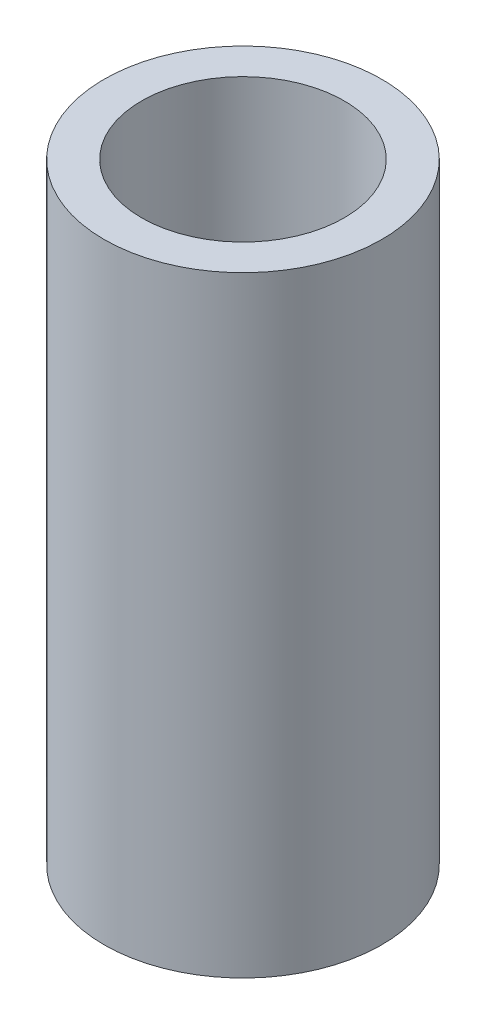
ISO-10303-21;
HEADER;
FILE_DESCRIPTION(('STEP AP214'),'2;1');
FILE_NAME('part.step','',(''),(''),'','','');
FILE_SCHEMA(('AUTOMOTIVE_DESIGN { 1 0 10303 214 1 1 1 1 }'));
ENDSEC;
DATA;
#1=APPLICATION_CONTEXT('core data for automotive mechanical design processes');
#2=APPLICATION_PROTOCOL_DEFINITION('international standard','automotive_design',2000,#1);
#3=PRODUCT_CONTEXT('',#1,'mechanical');
#4=PRODUCT('Part','Part','',(#3));
#5=PRODUCT_RELATED_PRODUCT_CATEGORY('part','',(#4));
#6=PRODUCT_DEFINITION_FORMATION('','',#4);
#7=PRODUCT_DEFINITION_CONTEXT('part definition',#1,'design');
#8=PRODUCT_DEFINITION('design','',#6,#7);
#9=PRODUCT_DEFINITION_SHAPE('','',#8);
#10=(LENGTH_UNIT() NAMED_UNIT(*) SI_UNIT(.MILLI.,.METRE.));
#11=(NAMED_UNIT(*) PLANE_ANGLE_UNIT() SI_UNIT($,.RADIAN.));
#12=(NAMED_UNIT(*) SI_UNIT($,.STERADIAN.) SOLID_ANGLE_UNIT());
#13=UNCERTAINTY_MEASURE_WITH_UNIT(LENGTH_MEASURE(1.E-05),#10,'distance_accuracy_value','');
#14=(GEOMETRIC_REPRESENTATION_CONTEXT(3) GLOBAL_UNCERTAINTY_ASSIGNED_CONTEXT((#13)) GLOBAL_UNIT_ASSIGNED_CONTEXT((#10,
#11,#12)) REPRESENTATION_CONTEXT('',''));
#15=CARTESIAN_POINT('',(0.,0.,0.));
#16=DIRECTION('',(0.,0.,1.));
#17=DIRECTION('',(1.,0.,0.));
#18=AXIS2_PLACEMENT_3D('',#15,#16,#17);
#19=CARTESIAN_POINT('',(0.,22.,0.));
#20=DIRECTION('',(0.,1.,0.));
#21=DIRECTION('',(0.,0.,1.));
#22=AXIS2_PLACEMENT_3D('',#19,#20,#21);
#23=PLANE('',#22);
#24=CARTESIAN_POINT('',(0.,22.,0.));
#25=DIRECTION('',(0.,1.,0.));
#26=DIRECTION('',(0.,0.,1.));
#27=AXIS2_PLACEMENT_3D('',#24,#25,#26);
#28=CIRCLE('',#27,5.);
#29=CARTESIAN_POINT('',(0.,22.,5.));
#30=VERTEX_POINT('',#29);
#31=EDGE_CURVE('E10',#30,#30,#28,.T.);
#32=ORIENTED_EDGE('',*,*,#31,.T.);
#33=EDGE_LOOP('',(#32));
#34=FACE_BOUND('',#33,.T.);
#35=CARTESIAN_POINT('',(0.,22.,0.));
#36=DIRECTION('',(0.,1.,0.));
#37=DIRECTION('',(0.,0.,1.));
#38=AXIS2_PLACEMENT_3D('',#35,#36,#37);
#39=CIRCLE('',#38,3.65);
#40=CARTESIAN_POINT('',(0.,22.,3.65));
#41=VERTEX_POINT('',#40);
#42=EDGE_CURVE('E44',#41,#41,#39,.T.);
#43=ORIENTED_EDGE('',*,*,#42,.F.);
#44=EDGE_LOOP('',(#43));
#45=FACE_BOUND('',#44,.T.);
#46=ADVANCED_FACE('F33',(#34,#45),#23,.T.);
#47=CARTESIAN_POINT('',(0.,0.,0.));
#48=DIRECTION('',(0.,1.,0.));
#49=DIRECTION('',(0.,0.,1.));
#50=AXIS2_PLACEMENT_3D('',#47,#48,#49);
#51=PLANE('',#50);
#52=CARTESIAN_POINT('',(0.,0.,0.));
#53=DIRECTION('',(0.,1.,0.));
#54=DIRECTION('',(0.,0.,1.));
#55=AXIS2_PLACEMENT_3D('',#52,#53,#54);
#56=CIRCLE('',#55,5.);
#57=CARTESIAN_POINT('',(0.,0.,5.));
#58=VERTEX_POINT('',#57);
#59=EDGE_CURVE('E37',#58,#58,#56,.T.);
#60=ORIENTED_EDGE('',*,*,#59,.F.);
#61=EDGE_LOOP('',(#60));
#62=FACE_BOUND('',#61,.T.);
#63=CARTESIAN_POINT('',(0.,0.,0.));
#64=DIRECTION('',(0.,1.,0.));
#65=DIRECTION('',(0.,0.,1.));
#66=AXIS2_PLACEMENT_3D('',#63,#64,#65);
#67=CIRCLE('',#66,3.65);
#68=CARTESIAN_POINT('',(0.,0.,3.65));
#69=VERTEX_POINT('',#68);
#70=EDGE_CURVE('E46',#69,#69,#67,.T.);
#71=ORIENTED_EDGE('',*,*,#70,.T.);
#72=EDGE_LOOP('',(#71));
#73=FACE_BOUND('',#72,.T.);
#74=ADVANCED_FACE('F56',(#62,#73),#51,.F.);
#75=CARTESIAN_POINT('',(0.,22.,0.));
#76=DIRECTION('',(0.,-1.,0.));
#77=DIRECTION('',(0.,0.,-1.));
#78=AXIS2_PLACEMENT_3D('',#75,#76,#77);
#79=CYLINDRICAL_SURFACE('',#78,5.);
#80=ORIENTED_EDGE('',*,*,#31,.F.);
#81=EDGE_LOOP('',(#80));
#82=FACE_BOUND('',#81,.T.);
#83=ORIENTED_EDGE('',*,*,#59,.T.);
#84=EDGE_LOOP('',(#83));
#85=FACE_BOUND('',#84,.T.);
#86=ADVANCED_FACE('F35',(#82,#85),#79,.T.);
#87=CARTESIAN_POINT('',(0.,22.,0.));
#88=DIRECTION('',(0.,-1.,0.));
#89=DIRECTION('',(0.,0.,-1.));
#90=AXIS2_PLACEMENT_3D('',#87,#88,#89);
#91=CYLINDRICAL_SURFACE('',#90,3.65);
#92=ORIENTED_EDGE('',*,*,#42,.T.);
#93=EDGE_LOOP('',(#92));
#94=FACE_BOUND('',#93,.T.);
#95=ORIENTED_EDGE('',*,*,#70,.F.);
#96=EDGE_LOOP('',(#95));
#97=FACE_BOUND('',#96,.T.);
#98=ADVANCED_FACE('F52',(#94,#97),#91,.F.);
#99=CLOSED_SHELL('',(#46,#74,#86,#98));
#100=MANIFOLD_SOLID_BREP('B2',#99);
#101=ADVANCED_BREP_SHAPE_REPRESENTATION('',(#18,#100),#14);
#102=SHAPE_DEFINITION_REPRESENTATION(#9,#101);
ENDSEC;
END-ISO-10303-21;
